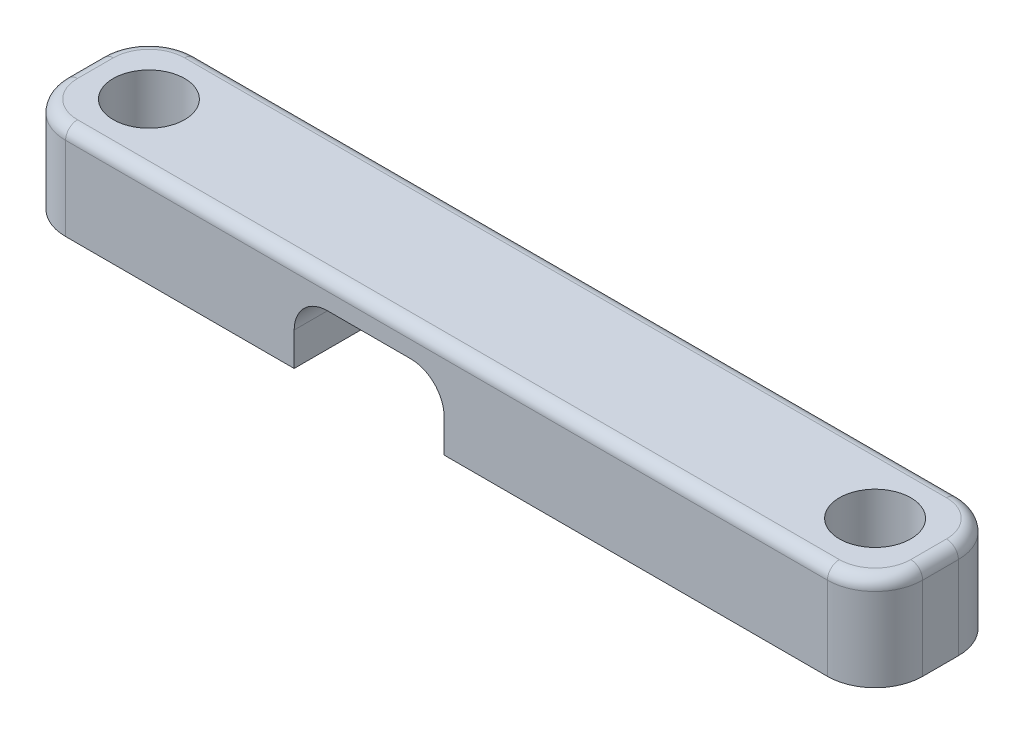
ISO-10303-21;
HEADER;
FILE_DESCRIPTION(('STEP AP214'),'2;1');
FILE_NAME('part.step','',(''),(''),'','','');
FILE_SCHEMA(('AUTOMOTIVE_DESIGN { 1 0 10303 214 1 1 1 1 }'));
ENDSEC;
DATA;
#1=APPLICATION_CONTEXT('core data for automotive mechanical design processes');
#2=APPLICATION_PROTOCOL_DEFINITION('international standard','automotive_design',2000,#1);
#3=PRODUCT_CONTEXT('',#1,'mechanical');
#4=PRODUCT('Part','Part','',(#3));
#5=PRODUCT_RELATED_PRODUCT_CATEGORY('part','',(#4));
#6=PRODUCT_DEFINITION_FORMATION('','',#4);
#7=PRODUCT_DEFINITION_CONTEXT('part definition',#1,'design');
#8=PRODUCT_DEFINITION('design','',#6,#7);
#9=PRODUCT_DEFINITION_SHAPE('','',#8);
#10=(LENGTH_UNIT() NAMED_UNIT(*) SI_UNIT(.MILLI.,.METRE.));
#11=(NAMED_UNIT(*) PLANE_ANGLE_UNIT() SI_UNIT($,.RADIAN.));
#12=(NAMED_UNIT(*) SI_UNIT($,.STERADIAN.) SOLID_ANGLE_UNIT());
#13=UNCERTAINTY_MEASURE_WITH_UNIT(LENGTH_MEASURE(1.E-05),#10,'distance_accuracy_value','');
#14=(GEOMETRIC_REPRESENTATION_CONTEXT(3) GLOBAL_UNCERTAINTY_ASSIGNED_CONTEXT((#13)) GLOBAL_UNIT_ASSIGNED_CONTEXT((#10,
#11,#12)) REPRESENTATION_CONTEXT('',''));
#15=CARTESIAN_POINT('',(0.,0.,0.));
#16=DIRECTION('',(0.,0.,1.));
#17=DIRECTION('',(1.,0.,0.));
#18=AXIS2_PLACEMENT_3D('',#15,#16,#17);
#19=CARTESIAN_POINT('',(0.,0.,0.));
#20=DIRECTION('',(0.,1.,0.));
#21=DIRECTION('',(0.,0.,1.));
#22=AXIS2_PLACEMENT_3D('',#19,#20,#21);
#23=PLANE('',#22);
#24=CARTESIAN_POINT('',(-15.25,0.,0.));
#25=DIRECTION('',(0.,1.,0.));
#26=DIRECTION('',(0.,0.,1.));
#27=AXIS2_PLACEMENT_3D('',#24,#25,#26);
#28=CIRCLE('',#27,1.5);
#29=CARTESIAN_POINT('',(-15.25,0.,1.5));
#30=VERTEX_POINT('',#29);
#31=EDGE_CURVE('E239',#30,#30,#28,.T.);
#32=ORIENTED_EDGE('',*,*,#31,.T.);
#33=EDGE_LOOP('',(#32));
#34=FACE_BOUND('',#33,.T.);
#35=DIRECTION('',(0.,0.,1.));
#36=VECTOR('',#35,1.);
#37=CARTESIAN_POINT('',(-18.,0.,-2.75));
#38=LINE('',#37,#36);
#39=CARTESIAN_POINT('',(-18.,0.,-0.749999999999998));
#40=VERTEX_POINT('',#39);
#41=CARTESIAN_POINT('',(-18.,0.,0.750000000000001));
#42=VERTEX_POINT('',#41);
#43=EDGE_CURVE('E258',#40,#42,#38,.T.);
#44=ORIENTED_EDGE('',*,*,#43,.F.);
#45=CARTESIAN_POINT('',(-16.,0.,-0.749999999999998));
#46=DIRECTION('',(0.,1.,0.));
#47=DIRECTION('',(0.,0.,1.));
#48=AXIS2_PLACEMENT_3D('',#45,#46,#47);
#49=CIRCLE('',#48,2.);
#50=CARTESIAN_POINT('',(-16.,0.,-2.75));
#51=VERTEX_POINT('',#50);
#52=EDGE_CURVE('E301',#40,#51,#49,.F.);
#53=ORIENTED_EDGE('',*,*,#52,.T.);
#54=DIRECTION('',(-1.,0.,0.));
#55=VECTOR('',#54,1.);
#56=CARTESIAN_POINT('',(-18.,0.,-2.75));
#57=LINE('',#56,#55);
#58=CARTESIAN_POINT('',(-6.39999999999999,0.,-2.75));
#59=VERTEX_POINT('',#58);
#60=EDGE_CURVE('E254',#59,#51,#57,.T.);
#61=ORIENTED_EDGE('',*,*,#60,.F.);
#62=DIRECTION('',(0.,0.,1.));
#63=VECTOR('',#62,1.);
#64=CARTESIAN_POINT('',(-6.39999999999999,0.,-9.64420046125727));
#65=LINE('',#64,#63);
#66=CARTESIAN_POINT('',(-6.39999999999999,0.,2.75));
#67=VERTEX_POINT('',#66);
#68=EDGE_CURVE('E216',#59,#67,#65,.T.);
#69=ORIENTED_EDGE('',*,*,#68,.T.);
#70=DIRECTION('',(1.,0.,0.));
#71=VECTOR('',#70,1.);
#72=CARTESIAN_POINT('',(-18.,0.,2.75));
#73=LINE('',#72,#71);
#74=CARTESIAN_POINT('',(-16.,0.,2.75));
#75=VERTEX_POINT('',#74);
#76=EDGE_CURVE('E263',#75,#67,#73,.T.);
#77=ORIENTED_EDGE('',*,*,#76,.F.);
#78=CARTESIAN_POINT('',(-16.,0.,0.750000000000001));
#79=DIRECTION('',(0.,1.,0.));
#80=DIRECTION('',(0.,0.,1.));
#81=AXIS2_PLACEMENT_3D('',#78,#79,#80);
#82=CIRCLE('',#81,2.);
#83=EDGE_CURVE('E298',#75,#42,#82,.F.);
#84=ORIENTED_EDGE('',*,*,#83,.T.);
#85=EDGE_LOOP('',(#44,#53,#61,#69,#77,#84));
#86=FACE_BOUND('',#85,.T.);
#87=ADVANCED_FACE('F45',(#34,#86),#23,.F.);
#88=CARTESIAN_POINT('',(0.,4.,0.));
#89=DIRECTION('',(0.,1.,0.));
#90=DIRECTION('',(0.,0.,1.));
#91=AXIS2_PLACEMENT_3D('',#88,#89,#90);
#92=PLANE('',#91);
#93=DIRECTION('',(0.,0.,1.));
#94=VECTOR('',#93,1.);
#95=CARTESIAN_POINT('',(-17.5,4.,0.750000000000001));
#96=LINE('',#95,#94);
#97=CARTESIAN_POINT('',(-17.5,4.,-0.749999999999998));
#98=VERTEX_POINT('',#97);
#99=CARTESIAN_POINT('',(-17.5,4.,0.750000000000001));
#100=VERTEX_POINT('',#99);
#101=EDGE_CURVE('E322',#98,#100,#96,.T.);
#102=ORIENTED_EDGE('',*,*,#101,.T.);
#103=CARTESIAN_POINT('',(-16.,4.,0.750000000000001));
#104=DIRECTION('',(0.,1.,0.));
#105=DIRECTION('',(0.,0.,1.));
#106=AXIS2_PLACEMENT_3D('',#103,#104,#105);
#107=CIRCLE('',#106,1.5);
#108=CARTESIAN_POINT('',(-16.,4.,2.25));
#109=VERTEX_POINT('',#108);
#110=EDGE_CURVE('E325',#100,#109,#107,.T.);
#111=ORIENTED_EDGE('',*,*,#110,.T.);
#112=DIRECTION('',(1.,0.,0.));
#113=VECTOR('',#112,1.);
#114=CARTESIAN_POINT('',(16.,4.,2.25));
#115=LINE('',#114,#113);
#116=CARTESIAN_POINT('',(16.,4.,2.25));
#117=VERTEX_POINT('',#116);
#118=EDGE_CURVE('E304',#109,#117,#115,.T.);
#119=ORIENTED_EDGE('',*,*,#118,.T.);
#120=CARTESIAN_POINT('',(16.,4.,0.750000000000002));
#121=DIRECTION('',(0.,1.,0.));
#122=DIRECTION('',(0.,0.,1.));
#123=AXIS2_PLACEMENT_3D('',#120,#121,#122);
#124=CIRCLE('',#123,1.5);
#125=CARTESIAN_POINT('',(17.5,4.,0.750000000000002));
#126=VERTEX_POINT('',#125);
#127=EDGE_CURVE('E307',#117,#126,#124,.T.);
#128=ORIENTED_EDGE('',*,*,#127,.T.);
#129=DIRECTION('',(0.,0.,-1.));
#130=VECTOR('',#129,1.);
#131=CARTESIAN_POINT('',(17.5,4.,-0.749999999999998));
#132=LINE('',#131,#130);
#133=CARTESIAN_POINT('',(17.5,4.,-0.749999999999998));
#134=VERTEX_POINT('',#133);
#135=EDGE_CURVE('E310',#126,#134,#132,.T.);
#136=ORIENTED_EDGE('',*,*,#135,.T.);
#137=CARTESIAN_POINT('',(16.,4.,-0.749999999999998));
#138=DIRECTION('',(0.,1.,0.));
#139=DIRECTION('',(0.,0.,1.));
#140=AXIS2_PLACEMENT_3D('',#137,#138,#139);
#141=CIRCLE('',#140,1.5);
#142=CARTESIAN_POINT('',(16.,4.,-2.25));
#143=VERTEX_POINT('',#142);
#144=EDGE_CURVE('E313',#134,#143,#141,.T.);
#145=ORIENTED_EDGE('',*,*,#144,.T.);
#146=DIRECTION('',(-1.,0.,0.));
#147=VECTOR('',#146,1.);
#148=CARTESIAN_POINT('',(-16.,4.,-2.25));
#149=LINE('',#148,#147);
#150=CARTESIAN_POINT('',(-16.,4.,-2.25));
#151=VERTEX_POINT('',#150);
#152=EDGE_CURVE('E316',#143,#151,#149,.T.);
#153=ORIENTED_EDGE('',*,*,#152,.T.);
#154=CARTESIAN_POINT('',(-16.,4.,-0.749999999999998));
#155=DIRECTION('',(0.,1.,0.));
#156=DIRECTION('',(0.,0.,1.));
#157=AXIS2_PLACEMENT_3D('',#154,#155,#156);
#158=CIRCLE('',#157,1.5);
#159=EDGE_CURVE('E319',#151,#98,#158,.T.);
#160=ORIENTED_EDGE('',*,*,#159,.T.);
#161=EDGE_LOOP('',(#102,#111,#119,#128,#136,#145,#153,#160));
#162=FACE_BOUND('',#161,.T.);
#163=CARTESIAN_POINT('',(-15.25,4.,0.));
#164=DIRECTION('',(0.,1.,0.));
#165=DIRECTION('',(0.,0.,1.));
#166=AXIS2_PLACEMENT_3D('',#163,#164,#165);
#167=CIRCLE('',#166,1.5);
#168=CARTESIAN_POINT('',(-15.25,4.,1.5));
#169=VERTEX_POINT('',#168);
#170=EDGE_CURVE('E243',#169,#169,#167,.T.);
#171=ORIENTED_EDGE('',*,*,#170,.F.);
#172=EDGE_LOOP('',(#171));
#173=FACE_BOUND('',#172,.T.);
#174=CARTESIAN_POINT('',(15.25,4.,0.));
#175=DIRECTION('',(0.,1.,0.));
#176=DIRECTION('',(0.,0.,-1.));
#177=AXIS2_PLACEMENT_3D('',#174,#175,#176);
#178=CIRCLE('',#177,1.5);
#179=CARTESIAN_POINT('',(15.25,4.,-1.5));
#180=VERTEX_POINT('',#179);
#181=EDGE_CURVE('E235',#180,#180,#178,.T.);
#182=ORIENTED_EDGE('',*,*,#181,.F.);
#183=EDGE_LOOP('',(#182));
#184=FACE_BOUND('',#183,.T.);
#185=ADVANCED_FACE('F422',(#162,#173,#184),#92,.T.);
#186=CARTESIAN_POINT('',(16.,0.,-2.75));
#187=VERTEX_POINT('',#186);
#188=CARTESIAN_POINT('',(-0.0999999999999873,0.,-2.75));
#189=VERTEX_POINT('',#188);
#190=EDGE_CURVE('E255',#187,#189,#57,.T.);
#191=ORIENTED_EDGE('',*,*,#190,.F.);
#192=CARTESIAN_POINT('',(16.,0.,-0.749999999999998));
#193=DIRECTION('',(0.,1.,0.));
#194=DIRECTION('',(0.,0.,1.));
#195=AXIS2_PLACEMENT_3D('',#192,#193,#194);
#196=CIRCLE('',#195,2.);
#197=CARTESIAN_POINT('',(18.,0.,-0.749999999999998));
#198=VERTEX_POINT('',#197);
#199=EDGE_CURVE('E276',#187,#198,#196,.F.);
#200=ORIENTED_EDGE('',*,*,#199,.T.);
#201=DIRECTION('',(0.,0.,-1.));
#202=VECTOR('',#201,1.);
#203=CARTESIAN_POINT('',(18.,0.,-2.75));
#204=LINE('',#203,#202);
#205=CARTESIAN_POINT('',(18.,0.,0.750000000000002));
#206=VERTEX_POINT('',#205);
#207=EDGE_CURVE('E247',#206,#198,#204,.T.);
#208=ORIENTED_EDGE('',*,*,#207,.F.);
#209=CARTESIAN_POINT('',(16.,0.,0.750000000000002));
#210=DIRECTION('',(0.,1.,0.));
#211=DIRECTION('',(0.,0.,1.));
#212=AXIS2_PLACEMENT_3D('',#209,#210,#211);
#213=CIRCLE('',#212,2.);
#214=CARTESIAN_POINT('',(16.,0.,2.75));
#215=VERTEX_POINT('',#214);
#216=EDGE_CURVE('E273',#206,#215,#213,.F.);
#217=ORIENTED_EDGE('',*,*,#216,.T.);
#218=CARTESIAN_POINT('',(-0.099999999999989,0.,2.75));
#219=VERTEX_POINT('',#218);
#220=EDGE_CURVE('E262',#219,#215,#73,.T.);
#221=ORIENTED_EDGE('',*,*,#220,.F.);
#222=DIRECTION('',(0.,0.,1.));
#223=VECTOR('',#222,1.);
#224=CARTESIAN_POINT('',(-0.0999999999999873,0.,-9.64420046125727));
#225=LINE('',#224,#223);
#226=EDGE_CURVE('E187',#189,#219,#225,.T.);
#227=ORIENTED_EDGE('',*,*,#226,.F.);
#228=EDGE_LOOP('',(#191,#200,#208,#217,#221,#227));
#229=FACE_BOUND('',#228,.T.);
#230=CARTESIAN_POINT('',(15.25,0.,0.));
#231=DIRECTION('',(0.,1.,0.));
#232=DIRECTION('',(0.,0.,-1.));
#233=AXIS2_PLACEMENT_3D('',#230,#231,#232);
#234=CIRCLE('',#233,1.5);
#235=CARTESIAN_POINT('',(15.25,0.,-1.5));
#236=VERTEX_POINT('',#235);
#237=EDGE_CURVE('E233',#236,#236,#234,.T.);
#238=ORIENTED_EDGE('',*,*,#237,.T.);
#239=EDGE_LOOP('',(#238));
#240=FACE_BOUND('',#239,.T.);
#241=ADVANCED_FACE('F397',(#229,#240),#23,.F.);
#242=CARTESIAN_POINT('',(18.,4.,-2.75));
#243=DIRECTION('',(-1.,0.,0.));
#244=DIRECTION('',(0.,0.,1.));
#245=AXIS2_PLACEMENT_3D('',#242,#243,#244);
#246=PLANE('',#245);
#247=DIRECTION('',(0.,-1.,0.));
#248=VECTOR('',#247,1.);
#249=CARTESIAN_POINT('',(18.,4.,-0.749999999999998));
#250=LINE('',#249,#248);
#251=CARTESIAN_POINT('',(18.,3.5,-0.749999999999998));
#252=VERTEX_POINT('',#251);
#253=EDGE_CURVE('E282',#198,#252,#250,.F.);
#254=ORIENTED_EDGE('',*,*,#253,.T.);
#255=DIRECTION('',(0.,0.,-1.));
#256=VECTOR('',#255,1.);
#257=CARTESIAN_POINT('',(18.,3.5,0.750000000000002));
#258=LINE('',#257,#256);
#259=CARTESIAN_POINT('',(18.,3.5,0.750000000000002));
#260=VERTEX_POINT('',#259);
#261=EDGE_CURVE('E70',#252,#260,#258,.F.);
#262=ORIENTED_EDGE('',*,*,#261,.T.);
#263=DIRECTION('',(0.,-1.,0.));
#264=VECTOR('',#263,1.);
#265=CARTESIAN_POINT('',(18.,4.,0.750000000000002));
#266=LINE('',#265,#264);
#267=EDGE_CURVE('E279',#260,#206,#266,.T.);
#268=ORIENTED_EDGE('',*,*,#267,.T.);
#269=ORIENTED_EDGE('',*,*,#207,.T.);
#270=EDGE_LOOP('',(#254,#262,#268,#269));
#271=FACE_BOUND('',#270,.T.);
#272=ADVANCED_FACE('F392',(#271),#246,.F.);
#273=CARTESIAN_POINT('',(-18.,4.,-2.75));
#274=DIRECTION('',(0.,0.,1.));
#275=DIRECTION('',(1.,0.,0.));
#276=AXIS2_PLACEMENT_3D('',#273,#274,#275);
#277=PLANE('',#276);
#278=DIRECTION('',(0.,-1.,0.));
#279=VECTOR('',#278,1.);
#280=CARTESIAN_POINT('',(-16.,4.,-2.75));
#281=LINE('',#280,#279);
#282=CARTESIAN_POINT('',(-16.,3.5,-2.75));
#283=VERTEX_POINT('',#282);
#284=EDGE_CURVE('E266',#51,#283,#281,.F.);
#285=ORIENTED_EDGE('',*,*,#284,.T.);
#286=DIRECTION('',(-1.,0.,0.));
#287=VECTOR('',#286,1.);
#288=CARTESIAN_POINT('',(16.,3.5,-2.75));
#289=LINE('',#288,#287);
#290=CARTESIAN_POINT('',(16.,3.5,-2.75));
#291=VERTEX_POINT('',#290);
#292=EDGE_CURVE('E339',#283,#291,#289,.F.);
#293=ORIENTED_EDGE('',*,*,#292,.T.);
#294=DIRECTION('',(0.,-1.,0.));
#295=VECTOR('',#294,1.);
#296=CARTESIAN_POINT('',(16.,4.,-2.75));
#297=LINE('',#296,#295);
#298=EDGE_CURVE('E270',#291,#187,#297,.T.);
#299=ORIENTED_EDGE('',*,*,#298,.T.);
#300=ORIENTED_EDGE('',*,*,#190,.T.);
#301=DIRECTION('',(0.,-1.,0.));
#302=VECTOR('',#301,1.);
#303=CARTESIAN_POINT('',(-0.0999999999999873,0.,-2.75));
#304=LINE('',#303,#302);
#305=CARTESIAN_POINT('',(-0.0999999999999876,1.4,-2.75));
#306=VERTEX_POINT('',#305);
#307=EDGE_CURVE('E230',#306,#189,#304,.T.);
#308=ORIENTED_EDGE('',*,*,#307,.F.);
#309=CARTESIAN_POINT('',(-1.49999999999999,1.4,-2.75));
#310=DIRECTION('',(0.,0.,1.));
#311=DIRECTION('',(1.,0.,0.));
#312=AXIS2_PLACEMENT_3D('',#309,#310,#311);
#313=CIRCLE('',#312,1.4);
#314=CARTESIAN_POINT('',(-1.49999999999999,2.8,-2.75));
#315=VERTEX_POINT('',#314);
#316=EDGE_CURVE('E181',#315,#306,#313,.F.);
#317=ORIENTED_EDGE('',*,*,#316,.F.);
#318=DIRECTION('',(-1.,0.,0.));
#319=VECTOR('',#318,1.);
#320=CARTESIAN_POINT('',(0.,2.8,-2.75));
#321=LINE('',#320,#319);
#322=CARTESIAN_POINT('',(-4.99999999999999,2.8,-2.75));
#323=VERTEX_POINT('',#322);
#324=EDGE_CURVE('E661',#315,#323,#321,.T.);
#325=ORIENTED_EDGE('',*,*,#324,.T.);
#326=CARTESIAN_POINT('',(-4.99999999999999,1.4,-2.75));
#327=DIRECTION('',(0.,0.,1.));
#328=DIRECTION('',(1.,0.,0.));
#329=AXIS2_PLACEMENT_3D('',#326,#327,#328);
#330=CIRCLE('',#329,1.4);
#331=CARTESIAN_POINT('',(-6.39999999999999,1.4,-2.75));
#332=VERTEX_POINT('',#331);
#333=EDGE_CURVE('E659',#332,#323,#330,.F.);
#334=ORIENTED_EDGE('',*,*,#333,.F.);
#335=DIRECTION('',(0.,1.,0.));
#336=VECTOR('',#335,1.);
#337=CARTESIAN_POINT('',(-6.39999999999999,0.,-2.75));
#338=LINE('',#337,#336);
#339=EDGE_CURVE('E234',#59,#332,#338,.T.);
#340=ORIENTED_EDGE('',*,*,#339,.F.);
#341=ORIENTED_EDGE('',*,*,#60,.T.);
#342=EDGE_LOOP('',(#285,#293,#299,#300,#308,#317,#325,#334,#340,#341));
#343=FACE_BOUND('',#342,.T.);
#344=ADVANCED_FACE('F400',(#343),#277,.F.);
#345=CARTESIAN_POINT('',(-18.,4.,-2.75));
#346=DIRECTION('',(1.,0.,0.));
#347=DIRECTION('',(0.,0.,-1.));
#348=AXIS2_PLACEMENT_3D('',#345,#346,#347);
#349=PLANE('',#348);
#350=DIRECTION('',(0.,-1.,0.));
#351=VECTOR('',#350,1.);
#352=CARTESIAN_POINT('',(-18.,4.,0.750000000000001));
#353=LINE('',#352,#351);
#354=CARTESIAN_POINT('',(-18.,3.5,0.750000000000001));
#355=VERTEX_POINT('',#354);
#356=EDGE_CURVE('E291',#42,#355,#353,.F.);
#357=ORIENTED_EDGE('',*,*,#356,.T.);
#358=DIRECTION('',(0.,0.,1.));
#359=VECTOR('',#358,1.);
#360=CARTESIAN_POINT('',(-18.,3.5,-0.749999999999998));
#361=LINE('',#360,#359);
#362=CARTESIAN_POINT('',(-18.,3.5,-0.749999999999998));
#363=VERTEX_POINT('',#362);
#364=EDGE_CURVE('E333',#355,#363,#361,.F.);
#365=ORIENTED_EDGE('',*,*,#364,.T.);
#366=DIRECTION('',(0.,-1.,0.));
#367=VECTOR('',#366,1.);
#368=CARTESIAN_POINT('',(-18.,4.,-0.749999999999998));
#369=LINE('',#368,#367);
#370=EDGE_CURVE('E295',#363,#40,#369,.T.);
#371=ORIENTED_EDGE('',*,*,#370,.T.);
#372=ORIENTED_EDGE('',*,*,#43,.T.);
#373=EDGE_LOOP('',(#357,#365,#371,#372));
#374=FACE_BOUND('',#373,.T.);
#375=ADVANCED_FACE('F469',(#374),#349,.F.);
#376=CARTESIAN_POINT('',(-18.,4.,2.75));
#377=DIRECTION('',(0.,0.,-1.));
#378=DIRECTION('',(-1.,0.,0.));
#379=AXIS2_PLACEMENT_3D('',#376,#377,#378);
#380=PLANE('',#379);
#381=DIRECTION('',(0.,-1.,0.));
#382=VECTOR('',#381,1.);
#383=CARTESIAN_POINT('',(16.,4.,2.75));
#384=LINE('',#383,#382);
#385=CARTESIAN_POINT('',(16.,3.5,2.75));
#386=VERTEX_POINT('',#385);
#387=EDGE_CURVE('E288',#215,#386,#384,.F.);
#388=ORIENTED_EDGE('',*,*,#387,.T.);
#389=DIRECTION('',(1.,0.,0.));
#390=VECTOR('',#389,1.);
#391=CARTESIAN_POINT('',(-16.,3.5,2.75));
#392=LINE('',#391,#390);
#393=CARTESIAN_POINT('',(-16.,3.5,2.75));
#394=VERTEX_POINT('',#393);
#395=EDGE_CURVE('E11',#386,#394,#392,.F.);
#396=ORIENTED_EDGE('',*,*,#395,.T.);
#397=DIRECTION('',(0.,-1.,0.));
#398=VECTOR('',#397,1.);
#399=CARTESIAN_POINT('',(-16.,4.,2.75));
#400=LINE('',#399,#398);
#401=EDGE_CURVE('E285',#394,#75,#400,.T.);
#402=ORIENTED_EDGE('',*,*,#401,.T.);
#403=ORIENTED_EDGE('',*,*,#76,.T.);
#404=DIRECTION('',(0.,-1.,0.));
#405=VECTOR('',#404,1.);
#406=CARTESIAN_POINT('',(-6.39999999999999,0.,2.75));
#407=LINE('',#406,#405);
#408=CARTESIAN_POINT('',(-6.39999999999999,1.4,2.75));
#409=VERTEX_POINT('',#408);
#410=EDGE_CURVE('E212',#409,#67,#407,.T.);
#411=ORIENTED_EDGE('',*,*,#410,.F.);
#412=CARTESIAN_POINT('',(-4.99999999999999,1.4,2.75));
#413=DIRECTION('',(0.,0.,1.));
#414=DIRECTION('',(1.,0.,0.));
#415=AXIS2_PLACEMENT_3D('',#412,#413,#414);
#416=CIRCLE('',#415,1.4);
#417=CARTESIAN_POINT('',(-4.99999999999999,2.8,2.75));
#418=VERTEX_POINT('',#417);
#419=EDGE_CURVE('E205',#418,#409,#416,.T.);
#420=ORIENTED_EDGE('',*,*,#419,.F.);
#421=DIRECTION('',(1.,0.,0.));
#422=VECTOR('',#421,1.);
#423=CARTESIAN_POINT('',(0.,2.8,2.75));
#424=LINE('',#423,#422);
#425=CARTESIAN_POINT('',(-1.49999999999999,2.8,2.75));
#426=VERTEX_POINT('',#425);
#427=EDGE_CURVE('E201',#418,#426,#424,.T.);
#428=ORIENTED_EDGE('',*,*,#427,.T.);
#429=CARTESIAN_POINT('',(-1.49999999999999,1.4,2.75));
#430=DIRECTION('',(0.,0.,1.));
#431=DIRECTION('',(1.,0.,0.));
#432=AXIS2_PLACEMENT_3D('',#429,#430,#431);
#433=CIRCLE('',#432,1.4);
#434=CARTESIAN_POINT('',(-0.0999999999999876,1.4,2.75));
#435=VERTEX_POINT('',#434);
#436=EDGE_CURVE('E178',#435,#426,#433,.T.);
#437=ORIENTED_EDGE('',*,*,#436,.F.);
#438=DIRECTION('',(0.,1.,0.));
#439=VECTOR('',#438,1.);
#440=CARTESIAN_POINT('',(-0.0999999999999873,0.,2.75));
#441=LINE('',#440,#439);
#442=EDGE_CURVE('E190',#219,#435,#441,.T.);
#443=ORIENTED_EDGE('',*,*,#442,.F.);
#444=ORIENTED_EDGE('',*,*,#220,.T.);
#445=EDGE_LOOP('',(#388,#396,#402,#403,#411,#420,#428,#437,#443,#444));
#446=FACE_BOUND('',#445,.T.);
#447=ADVANCED_FACE('F198',(#446),#380,.F.);
#448=CARTESIAN_POINT('',(-15.25,4.,0.));
#449=DIRECTION('',(0.,-1.,0.));
#450=DIRECTION('',(0.,0.,-1.));
#451=AXIS2_PLACEMENT_3D('',#448,#449,#450);
#452=CYLINDRICAL_SURFACE('',#451,1.5);
#453=ORIENTED_EDGE('',*,*,#170,.T.);
#454=EDGE_LOOP('',(#453));
#455=FACE_BOUND('',#454,.T.);
#456=ORIENTED_EDGE('',*,*,#31,.F.);
#457=EDGE_LOOP('',(#456));
#458=FACE_BOUND('',#457,.T.);
#459=ADVANCED_FACE('F605',(#455,#458),#452,.F.);
#460=CARTESIAN_POINT('',(15.25,4.,0.));
#461=DIRECTION('',(0.,-1.,0.));
#462=DIRECTION('',(0.,0.,-1.));
#463=AXIS2_PLACEMENT_3D('',#460,#461,#462);
#464=CYLINDRICAL_SURFACE('',#463,1.5);
#465=ORIENTED_EDGE('',*,*,#181,.T.);
#466=EDGE_LOOP('',(#465));
#467=FACE_BOUND('',#466,.T.);
#468=ORIENTED_EDGE('',*,*,#237,.F.);
#469=EDGE_LOOP('',(#468));
#470=FACE_BOUND('',#469,.T.);
#471=ADVANCED_FACE('F591',(#467,#470),#464,.F.);
#472=CARTESIAN_POINT('',(-6.39999999999999,0.,-9.64420046125727));
#473=DIRECTION('',(-1.,0.,0.));
#474=DIRECTION('',(0.,-1.,0.));
#475=AXIS2_PLACEMENT_3D('',#472,#473,#474);
#476=PLANE('',#475);
#477=ORIENTED_EDGE('',*,*,#339,.T.);
#478=DIRECTION('',(0.,0.,1.));
#479=VECTOR('',#478,1.);
#480=CARTESIAN_POINT('',(-6.39999999999999,1.4,-9.64420046125727));
#481=LINE('',#480,#479);
#482=EDGE_CURVE('E220',#332,#409,#481,.T.);
#483=ORIENTED_EDGE('',*,*,#482,.T.);
#484=ORIENTED_EDGE('',*,*,#410,.T.);
#485=ORIENTED_EDGE('',*,*,#68,.F.);
#486=EDGE_LOOP('',(#477,#483,#484,#485));
#487=FACE_BOUND('',#486,.T.);
#488=ADVANCED_FACE('F583',(#487),#476,.F.);
#489=CARTESIAN_POINT('',(-4.99999999999999,1.4,-9.64420046125727));
#490=DIRECTION('',(0.,0.,1.));
#491=DIRECTION('',(1.,0.,0.));
#492=AXIS2_PLACEMENT_3D('',#489,#490,#491);
#493=CYLINDRICAL_SURFACE('',#492,1.4);
#494=ORIENTED_EDGE('',*,*,#333,.T.);
#495=DIRECTION('',(0.,0.,1.));
#496=VECTOR('',#495,1.);
#497=CARTESIAN_POINT('',(-4.99999999999999,2.8,-9.64420046125727));
#498=LINE('',#497,#496);
#499=EDGE_CURVE('E223',#323,#418,#498,.T.);
#500=ORIENTED_EDGE('',*,*,#499,.T.);
#501=ORIENTED_EDGE('',*,*,#419,.T.);
#502=ORIENTED_EDGE('',*,*,#482,.F.);
#503=EDGE_LOOP('',(#494,#500,#501,#502));
#504=FACE_BOUND('',#503,.T.);
#505=ADVANCED_FACE('F574',(#504),#493,.F.);
#506=CARTESIAN_POINT('',(0.,2.8,-9.64420046125727));
#507=DIRECTION('',(0.,-1.,0.));
#508=DIRECTION('',(1.,0.,0.));
#509=AXIS2_PLACEMENT_3D('',#506,#507,#508);
#510=PLANE('',#509);
#511=DIRECTION('',(0.,0.,1.));
#512=VECTOR('',#511,1.);
#513=CARTESIAN_POINT('',(-1.49999999999999,2.8,-9.64420046125727));
#514=LINE('',#513,#512);
#515=EDGE_CURVE('E186',#315,#426,#514,.T.);
#516=ORIENTED_EDGE('',*,*,#515,.T.);
#517=ORIENTED_EDGE('',*,*,#427,.F.);
#518=ORIENTED_EDGE('',*,*,#499,.F.);
#519=ORIENTED_EDGE('',*,*,#324,.F.);
#520=EDGE_LOOP('',(#516,#517,#518,#519));
#521=FACE_BOUND('',#520,.T.);
#522=ADVANCED_FACE('F566',(#521),#510,.T.);
#523=CARTESIAN_POINT('',(-1.49999999999999,1.4,-9.64420046125727));
#524=DIRECTION('',(0.,0.,1.));
#525=DIRECTION('',(1.,0.,0.));
#526=AXIS2_PLACEMENT_3D('',#523,#524,#525);
#527=CYLINDRICAL_SURFACE('',#526,1.4);
#528=ORIENTED_EDGE('',*,*,#316,.T.);
#529=DIRECTION('',(0.,0.,1.));
#530=VECTOR('',#529,1.);
#531=CARTESIAN_POINT('',(-0.0999999999999876,1.4,-9.64420046125727));
#532=LINE('',#531,#530);
#533=EDGE_CURVE('E173',#306,#435,#532,.T.);
#534=ORIENTED_EDGE('',*,*,#533,.T.);
#535=ORIENTED_EDGE('',*,*,#436,.T.);
#536=ORIENTED_EDGE('',*,*,#515,.F.);
#537=EDGE_LOOP('',(#528,#534,#535,#536));
#538=FACE_BOUND('',#537,.T.);
#539=ADVANCED_FACE('F175',(#538),#527,.F.);
#540=CARTESIAN_POINT('',(-0.0999999999999873,0.,-9.64420046125727));
#541=DIRECTION('',(1.,0.,0.));
#542=DIRECTION('',(0.,1.,0.));
#543=AXIS2_PLACEMENT_3D('',#540,#541,#542);
#544=PLANE('',#543);
#545=ORIENTED_EDGE('',*,*,#307,.T.);
#546=ORIENTED_EDGE('',*,*,#226,.T.);
#547=ORIENTED_EDGE('',*,*,#442,.T.);
#548=ORIENTED_EDGE('',*,*,#533,.F.);
#549=EDGE_LOOP('',(#545,#546,#547,#548));
#550=FACE_BOUND('',#549,.T.);
#551=ADVANCED_FACE('F191',(#550),#544,.F.);
#552=CARTESIAN_POINT('',(16.,4.,-0.749999999999998));
#553=DIRECTION('',(0.,-1.,0.));
#554=DIRECTION('',(0.,0.,-1.));
#555=AXIS2_PLACEMENT_3D('',#552,#553,#554);
#556=CYLINDRICAL_SURFACE('',#555,2.);
#557=ORIENTED_EDGE('',*,*,#298,.F.);
#558=CARTESIAN_POINT('',(16.,3.5,-0.749999999999998));
#559=DIRECTION('',(0.,1.,0.));
#560=DIRECTION('',(0.,0.,1.));
#561=AXIS2_PLACEMENT_3D('',#558,#559,#560);
#562=CIRCLE('',#561,2.);
#563=EDGE_CURVE('E342',#291,#252,#562,.F.);
#564=ORIENTED_EDGE('',*,*,#563,.T.);
#565=ORIENTED_EDGE('',*,*,#253,.F.);
#566=ORIENTED_EDGE('',*,*,#199,.F.);
#567=EDGE_LOOP('',(#557,#564,#565,#566));
#568=FACE_BOUND('',#567,.T.);
#569=ADVANCED_FACE('F390',(#568),#556,.T.);
#570=CARTESIAN_POINT('',(16.,4.,0.750000000000002));
#571=DIRECTION('',(0.,-1.,0.));
#572=DIRECTION('',(0.,0.,-1.));
#573=AXIS2_PLACEMENT_3D('',#570,#571,#572);
#574=CYLINDRICAL_SURFACE('',#573,2.);
#575=ORIENTED_EDGE('',*,*,#267,.F.);
#576=CARTESIAN_POINT('',(16.,3.5,0.750000000000002));
#577=DIRECTION('',(0.,1.,0.));
#578=DIRECTION('',(0.,0.,1.));
#579=AXIS2_PLACEMENT_3D('',#576,#577,#578);
#580=CIRCLE('',#579,2.);
#581=EDGE_CURVE('E55',#260,#386,#580,.F.);
#582=ORIENTED_EDGE('',*,*,#581,.T.);
#583=ORIENTED_EDGE('',*,*,#387,.F.);
#584=ORIENTED_EDGE('',*,*,#216,.F.);
#585=EDGE_LOOP('',(#575,#582,#583,#584));
#586=FACE_BOUND('',#585,.T.);
#587=ADVANCED_FACE('F475',(#586),#574,.T.);
#588=CARTESIAN_POINT('',(-16.,4.,-0.749999999999998));
#589=DIRECTION('',(0.,-1.,0.));
#590=DIRECTION('',(0.,0.,-1.));
#591=AXIS2_PLACEMENT_3D('',#588,#589,#590);
#592=CYLINDRICAL_SURFACE('',#591,2.);
#593=ORIENTED_EDGE('',*,*,#370,.F.);
#594=CARTESIAN_POINT('',(-16.,3.5,-0.749999999999998));
#595=DIRECTION('',(0.,1.,0.));
#596=DIRECTION('',(0.,0.,1.));
#597=AXIS2_PLACEMENT_3D('',#594,#595,#596);
#598=CIRCLE('',#597,2.);
#599=EDGE_CURVE('E336',#363,#283,#598,.F.);
#600=ORIENTED_EDGE('',*,*,#599,.T.);
#601=ORIENTED_EDGE('',*,*,#284,.F.);
#602=ORIENTED_EDGE('',*,*,#52,.F.);
#603=EDGE_LOOP('',(#593,#600,#601,#602));
#604=FACE_BOUND('',#603,.T.);
#605=ADVANCED_FACE('F408',(#604),#592,.T.);
#606=CARTESIAN_POINT('',(-16.,4.,0.750000000000001));
#607=DIRECTION('',(0.,-1.,0.));
#608=DIRECTION('',(0.,0.,-1.));
#609=AXIS2_PLACEMENT_3D('',#606,#607,#608);
#610=CYLINDRICAL_SURFACE('',#609,2.);
#611=ORIENTED_EDGE('',*,*,#401,.F.);
#612=CARTESIAN_POINT('',(-16.,3.5,0.750000000000001));
#613=DIRECTION('',(0.,1.,0.));
#614=DIRECTION('',(0.,0.,1.));
#615=AXIS2_PLACEMENT_3D('',#612,#613,#614);
#616=CIRCLE('',#615,2.);
#617=EDGE_CURVE('E329',#394,#355,#616,.F.);
#618=ORIENTED_EDGE('',*,*,#617,.T.);
#619=ORIENTED_EDGE('',*,*,#356,.F.);
#620=ORIENTED_EDGE('',*,*,#83,.F.);
#621=EDGE_LOOP('',(#611,#618,#619,#620));
#622=FACE_BOUND('',#621,.T.);
#623=ADVANCED_FACE('F439',(#622),#610,.T.);
#624=CARTESIAN_POINT('',(16.,3.5,-0.749999999999998));
#625=DIRECTION('',(0.,1.,0.));
#626=DIRECTION('',(0.,0.,1.));
#627=AXIS2_PLACEMENT_3D('',#624,#625,#626);
#628=TOROIDAL_SURFACE('',#627,1.5,0.5);
#629=CARTESIAN_POINT('',(17.5,3.5,-0.749999999999998));
#630=DIRECTION('',(0.,0.,1.));
#631=DIRECTION('',(1.,0.,0.));
#632=AXIS2_PLACEMENT_3D('',#629,#630,#631);
#633=CIRCLE('',#632,0.5);
#634=EDGE_CURVE('E370',#252,#134,#633,.T.);
#635=ORIENTED_EDGE('',*,*,#634,.F.);
#636=ORIENTED_EDGE('',*,*,#563,.F.);
#637=CARTESIAN_POINT('',(16.,3.5,-2.25));
#638=DIRECTION('',(-1.,0.,0.));
#639=DIRECTION('',(0.,0.,1.));
#640=AXIS2_PLACEMENT_3D('',#637,#638,#639);
#641=CIRCLE('',#640,0.5);
#642=EDGE_CURVE('E49',#143,#291,#641,.T.);
#643=ORIENTED_EDGE('',*,*,#642,.F.);
#644=ORIENTED_EDGE('',*,*,#144,.F.);
#645=EDGE_LOOP('',(#635,#636,#643,#644));
#646=FACE_BOUND('',#645,.T.);
#647=ADVANCED_FACE('F47',(#646),#628,.T.);
#648=CARTESIAN_POINT('',(0.,3.5,-2.25));
#649=DIRECTION('',(1.,0.,0.));
#650=DIRECTION('',(0.,0.,-1.));
#651=AXIS2_PLACEMENT_3D('',#648,#649,#650);
#652=CYLINDRICAL_SURFACE('',#651,0.5);
#653=ORIENTED_EDGE('',*,*,#642,.T.);
#654=ORIENTED_EDGE('',*,*,#292,.F.);
#655=CARTESIAN_POINT('',(-16.,3.5,-2.25));
#656=DIRECTION('',(-1.,0.,0.));
#657=DIRECTION('',(0.,0.,1.));
#658=AXIS2_PLACEMENT_3D('',#655,#656,#657);
#659=CIRCLE('',#658,0.5);
#660=EDGE_CURVE('E367',#151,#283,#659,.T.);
#661=ORIENTED_EDGE('',*,*,#660,.F.);
#662=ORIENTED_EDGE('',*,*,#152,.F.);
#663=EDGE_LOOP('',(#653,#654,#661,#662));
#664=FACE_BOUND('',#663,.T.);
#665=ADVANCED_FACE('F382',(#664),#652,.T.);
#666=CARTESIAN_POINT('',(17.5,3.5,0.));
#667=DIRECTION('',(0.,0.,1.));
#668=DIRECTION('',(1.,0.,0.));
#669=AXIS2_PLACEMENT_3D('',#666,#667,#668);
#670=CYLINDRICAL_SURFACE('',#669,0.5);
#671=ORIENTED_EDGE('',*,*,#634,.T.);
#672=ORIENTED_EDGE('',*,*,#135,.F.);
#673=CARTESIAN_POINT('',(17.5,3.5,0.750000000000002));
#674=DIRECTION('',(0.,0.,1.));
#675=DIRECTION('',(1.,0.,0.));
#676=AXIS2_PLACEMENT_3D('',#673,#674,#675);
#677=CIRCLE('',#676,0.5);
#678=EDGE_CURVE('E363',#260,#126,#677,.T.);
#679=ORIENTED_EDGE('',*,*,#678,.F.);
#680=ORIENTED_EDGE('',*,*,#261,.F.);
#681=EDGE_LOOP('',(#671,#672,#679,#680));
#682=FACE_BOUND('',#681,.T.);
#683=ADVANCED_FACE('F426',(#682),#670,.T.);
#684=CARTESIAN_POINT('',(-16.,3.5,-0.749999999999998));
#685=DIRECTION('',(0.,1.,0.));
#686=DIRECTION('',(0.,0.,1.));
#687=AXIS2_PLACEMENT_3D('',#684,#685,#686);
#688=TOROIDAL_SURFACE('',#687,1.5,0.5);
#689=ORIENTED_EDGE('',*,*,#660,.T.);
#690=ORIENTED_EDGE('',*,*,#599,.F.);
#691=CARTESIAN_POINT('',(-17.5,3.5,-0.749999999999998));
#692=DIRECTION('',(0.,0.,1.));
#693=DIRECTION('',(1.,0.,0.));
#694=AXIS2_PLACEMENT_3D('',#691,#692,#693);
#695=CIRCLE('',#694,0.5);
#696=EDGE_CURVE('E359',#98,#363,#695,.T.);
#697=ORIENTED_EDGE('',*,*,#696,.F.);
#698=ORIENTED_EDGE('',*,*,#159,.F.);
#699=EDGE_LOOP('',(#689,#690,#697,#698));
#700=FACE_BOUND('',#699,.T.);
#701=ADVANCED_FACE('F413',(#700),#688,.T.);
#702=CARTESIAN_POINT('',(16.,3.5,0.750000000000002));
#703=DIRECTION('',(0.,1.,0.));
#704=DIRECTION('',(0.,0.,1.));
#705=AXIS2_PLACEMENT_3D('',#702,#703,#704);
#706=TOROIDAL_SURFACE('',#705,1.5,0.5);
#707=ORIENTED_EDGE('',*,*,#678,.T.);
#708=ORIENTED_EDGE('',*,*,#127,.F.);
#709=CARTESIAN_POINT('',(16.,3.5,2.25));
#710=DIRECTION('',(-1.,0.,0.));
#711=DIRECTION('',(0.,0.,1.));
#712=AXIS2_PLACEMENT_3D('',#709,#710,#711);
#713=CIRCLE('',#712,0.5);
#714=EDGE_CURVE('E355',#386,#117,#713,.T.);
#715=ORIENTED_EDGE('',*,*,#714,.F.);
#716=ORIENTED_EDGE('',*,*,#581,.F.);
#717=EDGE_LOOP('',(#707,#708,#715,#716));
#718=FACE_BOUND('',#717,.T.);
#719=ADVANCED_FACE('F428',(#718),#706,.T.);
#720=CARTESIAN_POINT('',(-17.5,3.5,0.));
#721=DIRECTION('',(0.,0.,-1.));
#722=DIRECTION('',(-1.,0.,0.));
#723=AXIS2_PLACEMENT_3D('',#720,#721,#722);
#724=CYLINDRICAL_SURFACE('',#723,0.5);
#725=ORIENTED_EDGE('',*,*,#696,.T.);
#726=ORIENTED_EDGE('',*,*,#364,.F.);
#727=CARTESIAN_POINT('',(-17.5,3.5,0.750000000000001));
#728=DIRECTION('',(0.,0.,1.));
#729=DIRECTION('',(1.,0.,0.));
#730=AXIS2_PLACEMENT_3D('',#727,#728,#729);
#731=CIRCLE('',#730,0.5);
#732=EDGE_CURVE('E352',#100,#355,#731,.T.);
#733=ORIENTED_EDGE('',*,*,#732,.F.);
#734=ORIENTED_EDGE('',*,*,#101,.F.);
#735=EDGE_LOOP('',(#725,#726,#733,#734));
#736=FACE_BOUND('',#735,.T.);
#737=ADVANCED_FACE('F418',(#736),#724,.T.);
#738=CARTESIAN_POINT('',(0.,3.5,2.25));
#739=DIRECTION('',(-1.,0.,0.));
#740=DIRECTION('',(0.,0.,1.));
#741=AXIS2_PLACEMENT_3D('',#738,#739,#740);
#742=CYLINDRICAL_SURFACE('',#741,0.5);
#743=ORIENTED_EDGE('',*,*,#714,.T.);
#744=ORIENTED_EDGE('',*,*,#118,.F.);
#745=CARTESIAN_POINT('',(-16.,3.5,2.25));
#746=DIRECTION('',(-1.,0.,0.));
#747=DIRECTION('',(0.,0.,1.));
#748=AXIS2_PLACEMENT_3D('',#745,#746,#747);
#749=CIRCLE('',#748,0.5);
#750=EDGE_CURVE('E349',#394,#109,#749,.T.);
#751=ORIENTED_EDGE('',*,*,#750,.F.);
#752=ORIENTED_EDGE('',*,*,#395,.F.);
#753=EDGE_LOOP('',(#743,#744,#751,#752));
#754=FACE_BOUND('',#753,.T.);
#755=ADVANCED_FACE('F434',(#754),#742,.T.);
#756=CARTESIAN_POINT('',(-16.,3.5,0.750000000000001));
#757=DIRECTION('',(0.,1.,0.));
#758=DIRECTION('',(0.,0.,1.));
#759=AXIS2_PLACEMENT_3D('',#756,#757,#758);
#760=TOROIDAL_SURFACE('',#759,1.5,0.5);
#761=ORIENTED_EDGE('',*,*,#732,.T.);
#762=ORIENTED_EDGE('',*,*,#617,.F.);
#763=ORIENTED_EDGE('',*,*,#750,.T.);
#764=ORIENTED_EDGE('',*,*,#110,.F.);
#765=EDGE_LOOP('',(#761,#762,#763,#764));
#766=FACE_BOUND('',#765,.T.);
#767=ADVANCED_FACE('F443',(#766),#760,.T.);
#768=CLOSED_SHELL('',(#87,#185,#241,#272,#344,#375,#447,#459,#471,#488,#505,#522,#539,#551,#569,
#587,#605,#623,#647,#665,#683,#701,#719,#737,#755,#767));
#769=MANIFOLD_SOLID_BREP('B2',#768);
#770=ADVANCED_BREP_SHAPE_REPRESENTATION('',(#18,#769),#14);
#771=SHAPE_DEFINITION_REPRESENTATION(#9,#770);
ENDSEC;
END-ISO-10303-21;
